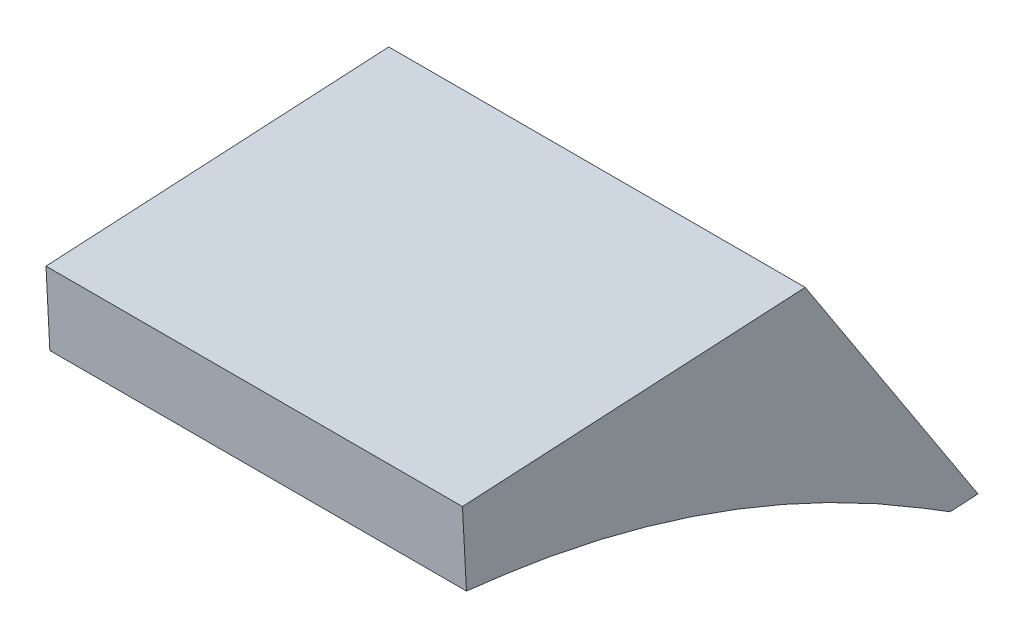
ISO-10303-21;
HEADER;
FILE_DESCRIPTION(('STEP AP214'),'2;1');
FILE_NAME('part.step','',(''),(''),'','','');
FILE_SCHEMA(('AUTOMOTIVE_DESIGN { 1 0 10303 214 1 1 1 1 }'));
ENDSEC;
DATA;
#1=APPLICATION_CONTEXT('core data for automotive mechanical design processes');
#2=APPLICATION_PROTOCOL_DEFINITION('international standard','automotive_design',2000,#1);
#3=PRODUCT_CONTEXT('',#1,'mechanical');
#4=PRODUCT('Part','Part','',(#3));
#5=PRODUCT_RELATED_PRODUCT_CATEGORY('part','',(#4));
#6=PRODUCT_DEFINITION_FORMATION('','',#4);
#7=PRODUCT_DEFINITION_CONTEXT('part definition',#1,'design');
#8=PRODUCT_DEFINITION('design','',#6,#7);
#9=PRODUCT_DEFINITION_SHAPE('','',#8);
#10=(LENGTH_UNIT() NAMED_UNIT(*) SI_UNIT(.MILLI.,.METRE.));
#11=(NAMED_UNIT(*) PLANE_ANGLE_UNIT() SI_UNIT($,.RADIAN.));
#12=(NAMED_UNIT(*) SI_UNIT($,.STERADIAN.) SOLID_ANGLE_UNIT());
#13=UNCERTAINTY_MEASURE_WITH_UNIT(LENGTH_MEASURE(1.E-05),#10,'distance_accuracy_value','');
#14=(GEOMETRIC_REPRESENTATION_CONTEXT(3) GLOBAL_UNCERTAINTY_ASSIGNED_CONTEXT((#13)) GLOBAL_UNIT_ASSIGNED_CONTEXT((#10,
#11,#12)) REPRESENTATION_CONTEXT('',''));
#15=CARTESIAN_POINT('',(0.,0.,0.));
#16=DIRECTION('',(0.,0.,1.));
#17=DIRECTION('',(1.,0.,0.));
#18=AXIS2_PLACEMENT_3D('',#15,#16,#17);
#19=CARTESIAN_POINT('',(-177.805940246243,-33.0381702413849,-314.355519034823));
#20=DIRECTION('',(-2.29475219526301E-07,0.0534934907984705,-0.998568198192863));
#21=DIRECTION('',(0.,0.99856819819289,0.053493490798472));
#22=AXIS2_PLACEMENT_3D('',#19,#20,#21);
#23=PLANE('',#22);
#24=CARTESIAN_POINT('',(-177.8,85.110750331542,-308.026258594133));
#25=CARTESIAN_POINT('',(-204.737394348035,85.1107449085178,-308.026252694317));
#26=CARTESIAN_POINT('',(-231.674788696068,85.1107454911889,-308.026246472776));
#27=CARTESIAN_POINT('',(-285.549577392135,85.1107586679218,-308.02623338624));
#28=CARTESIAN_POINT('',(-312.486971740168,85.1107712619836,-308.026226521246));
#29=CARTESIAN_POINT('',(-339.4243660882,85.1107898617407,-308.026219334526));
#30=B_SPLINE_CURVE_WITH_KNOTS('',3,(#24,#25,#26,#27,#28,#29),.UNSPECIFIED.,.F.,.F.,(4,2,4),(0.,
80.8121830441022,161.624366088213),.UNSPECIFIED.);
#31=CARTESIAN_POINT('',(-177.8,85.110750331542,-308.026258594133));
#32=VERTEX_POINT('',#31);
#33=CARTESIAN_POINT('',(-338.178220714968,85.1107887697366,-308.026219679411));
#34=VERTEX_POINT('',#33);
#35=EDGE_CURVE('E120',#32,#34,#30,.T.);
#36=ORIENTED_EDGE('',*,*,#35,.T.);
#37=DIRECTION('',(0.0023746530409731,0.998565382766486,0.0534933394298316));
#38=VECTOR('',#37,1.);
#39=CARTESIAN_POINT('',(-338.458280662959,-32.6572237938514,-314.335074741631));
#40=LINE('',#39,#38);
#41=CARTESIAN_POINT('',(-338.247088528495,56.1511835604797,-309.577591295045));
#42=VERTEX_POINT('',#41);
#43=EDGE_CURVE('E11',#42,#34,#40,.T.);
#44=ORIENTED_EDGE('',*,*,#43,.F.);
#45=CARTESIAN_POINT('',(-339.4243660882,56.15118359318,-309.577591022767));
#46=CARTESIAN_POINT('',(-285.549577392133,56.1511820966472,-309.577603483592));
#47=CARTESIAN_POINT('',(-231.674788696067,56.1511806001143,-309.577615944417));
#48=CARTESIAN_POINT('',(-177.8,56.1511791035814,-309.577628405242));
#49=B_SPLINE_CURVE_WITH_KNOTS('',3,(#45,#46,#47,#48),.UNSPECIFIED.,.F.,.F.,(4,4),(0.,
161.624366088204),.UNSPECIFIED.);
#50=CARTESIAN_POINT('',(-177.8,56.1511791040107,-309.577628401668));
#51=VERTEX_POINT('',#50);
#52=EDGE_CURVE('E49',#42,#51,#49,.T.);
#53=ORIENTED_EDGE('',*,*,#52,.T.);
#54=DIRECTION('',(0.,-0.99856819819289,-0.053493490798472));
#55=VECTOR('',#54,1.);
#56=CARTESIAN_POINT('',(-177.8,16.697356429359,-311.691177288541));
#57=LINE('',#56,#55);
#58=EDGE_CURVE('E107',#32,#51,#57,.T.);
#59=ORIENTED_EDGE('',*,*,#58,.F.);
#60=EDGE_LOOP('',(#36,#44,#53,#59));
#61=FACE_BOUND('',#60,.T.);
#62=ADVANCED_FACE('F42',(#61),#23,.F.);
#63=CARTESIAN_POINT('',(-338.458326349272,-22.0071834208376,-513.140414741347));
#64=DIRECTION('',(-0.999997180507466,0.00237124073306189,0.000127257626607574));
#65=DIRECTION('',(-0.00237124075226242,-0.999997188604695,0.));
#66=AXIS2_PLACEMENT_3D('',#63,#64,#65);
#67=PLANE('',#66);
#68=CARTESIAN_POINT('',(-338.178189933752,92.2083906021576,-440.036670150946));
#69=CARTESIAN_POINT('',(-338.178200434004,89.7872295623033,-395.004761254948));
#70=CARTESIAN_POINT('',(-338.178210934255,87.366068522449,-349.97285235895));
#71=CARTESIAN_POINT('',(-338.178221434506,84.9449074825947,-304.940943462951));
#72=B_SPLINE_CURVE_WITH_KNOTS('',3,(#68,#69,#70,#71),.UNSPECIFIED.,.F.,.F.,(4,4),(0.,
135.290848014145),.UNSPECIFIED.);
#73=CARTESIAN_POINT('',(-338.178189938581,92.208390602169,-440.036670150946));
#74=VERTEX_POINT('',#73);
#75=EDGE_CURVE('E113',#74,#34,#72,.T.);
#76=ORIENTED_EDGE('',*,*,#75,.F.);
#77=CARTESIAN_POINT('',(-338.431837937609,-11.1469924786984,-507.355257430313));
#78=CARTESIAN_POINT('',(-338.408916938738,-1.80724301481813,-501.271987354038));
#79=CARTESIAN_POINT('',(-338.385995938601,7.53250641209537,-495.188717221013));
#80=CARTESIAN_POINT('',(-338.340153936999,26.2120051929313,-483.022176842902));
#81=CARTESIAN_POINT('',(-338.317232935534,35.5517545468537,-476.938906597818));
#82=CARTESIAN_POINT('',(-338.255604598183,60.6637995458687,-460.582647738503));
#83=CARTESIAN_POINT('',(-338.216897262187,76.4360951242514,-450.309659021852));
#84=CARTESIAN_POINT('',(-338.178189928924,92.208390602169,-440.036670150946));
#85=B_SPLINE_CURVE_WITH_KNOTS('',3,(#77,#78,#79,#80,#81,#82,#83,#84),.UNSPECIFIED.,.F.,.F.,(4,2,
2,4),(0.,33.4385792486797,66.8771584973593,123.345821746806),.UNSPECIFIED.);
#86=CARTESIAN_POINT('',(-338.428909815339,-9.95401298745452,-506.577900493896));
#87=VERTEX_POINT('',#86);
#88=EDGE_CURVE('E162',#87,#74,#85,.T.);
#89=ORIENTED_EDGE('',*,*,#88,.F.);
#90=CARTESIAN_POINT('',(-338.428910514005,-9.95417148300831,-506.57767153548));
#91=CARTESIAN_POINT('',(-338.428910539208,-10.0069259570138,-505.594873412896));
#92=CARTESIAN_POINT('',(-338.428910564299,-10.0596804275362,-504.612075290126));
#93=CARTESIAN_POINT('',(-338.428910614351,-10.1651893616146,-502.64647904421));
#94=CARTESIAN_POINT('',(-338.428910639312,-10.2179438251707,-501.663680921065));
#95=CARTESIAN_POINT('',(-338.428910706009,-10.3590122650935,-499.035622595269));
#96=CARTESIAN_POINT('',(-338.428910747711,-10.4473262351817,-497.390362392281));
#97=CARTESIAN_POINT('',(-338.428910789578,-10.535640195508,-495.745102188769));
#98=B_SPLINE_CURVE_WITH_KNOTS('',3,(#90,#91,#92,#93,#94,#95,#96,#97),.UNSPECIFIED.,.F.,.F.,(4,2,
2,4),(0.,2.95263893128455,5.90527786256939,10.8481641080384),.UNSPECIFIED.);
#99=CARTESIAN_POINT('',(-338.428910053783,-10.5318760424426,-495.810901745932));
#100=VERTEX_POINT('',#99);
#101=EDGE_CURVE('E114',#87,#100,#98,.T.);
#102=ORIENTED_EDGE('',*,*,#101,.T.);
#103=DIRECTION('',(-0.00135449772366032,-0.525559783831621,-0.850755592961208));
#104=VECTOR('',#103,1.);
#105=CARTESIAN_POINT('',(-338.413417955101,-4.52070771895822,-486.080157673915));
#106=LINE('',#105,#104);
#107=CARTESIAN_POINT('',(-338.413712627311,-4.63504372721386,-486.265240325771));
#108=VERTEX_POINT('',#107);
#109=EDGE_CURVE('E161',#108,#100,#106,.T.);
#110=ORIENTED_EDGE('',*,*,#109,.F.);
#111=CARTESIAN_POINT('',(-338.245193516812,56.701510452045,-304.940943462951));
#112=CARTESIAN_POINT('',(-338.245473966705,56.6203852093187,-305.633095470086));
#113=CARTESIAN_POINT('',(-338.245755539894,56.5387832470412,-306.325191506279));
#114=CARTESIAN_POINT('',(-338.246320785259,56.3746885328478,-307.709279089255));
#115=CARTESIAN_POINT('',(-338.246604457438,56.2921957795255,-308.401270635871));
#116=CARTESIAN_POINT('',(-338.247173752533,56.1263823171187,-309.785155108789));
#117=CARTESIAN_POINT('',(-338.247459375451,56.0430616073133,-310.477048035004));
#118=CARTESIAN_POINT('',(-338.248032471305,55.875639293863,-311.860820732886));
#119=CARTESIAN_POINT('',(-338.248319944452,55.7915376008118,-312.552700493729));
#120=CARTESIAN_POINT('',(-338.248896516908,55.6226439118887,-313.936375804408));
#121=CARTESIAN_POINT('',(-338.249185616218,55.5378519160434,-314.628171354247));
#122=CARTESIAN_POINT('',(-338.249766279509,55.3672216145698,-316.011633683542));
#123=CARTESIAN_POINT('',(-338.250057843491,55.2813833086739,-316.703300462965));
#124=CARTESIAN_POINT('',(-338.250791455421,55.0648536632202,-318.433381027977));
#125=CARTESIAN_POINT('',(-338.251235621626,54.9332629970909,-319.471682687473));
#126=CARTESIAN_POINT('',(-338.252134588076,54.6655659526797,-321.547705847517));
#127=CARTESIAN_POINT('',(-338.252589388324,54.5294595735725,-322.58542734796));
#128=CARTESIAN_POINT('',(-338.253512620617,54.2514538661401,-324.660047463545));
#129=CARTESIAN_POINT('',(-338.253981052032,54.1095548051371,-325.696946114414));
#130=CARTESIAN_POINT('',(-338.254934579946,53.81867549613,-327.769752017501));
#131=CARTESIAN_POINT('',(-338.255419676411,53.6696952622995,-328.805659271699));
#132=CARTESIAN_POINT('',(-338.256162025501,53.4399724226615,-330.3585629953));
#133=CARTESIAN_POINT('',(-338.256411918463,53.3623584048005,-330.876023038004));
#134=CARTESIAN_POINT('',(-338.256917016466,53.2048717092642,-331.910599230866));
#135=CARTESIAN_POINT('',(-338.257172221505,53.1249990318647,-332.427715381067));
#136=CARTESIAN_POINT('',(-338.2579458082,52.8819907618856,-333.9785332789));
#137=CARTESIAN_POINT('',(-338.25847216201,52.7154647519583,-335.011705689106));
#138=CARTESIAN_POINT('',(-338.259545604024,52.3735913574122,-337.076610365416));
#139=CARTESIAN_POINT('',(-338.260092692666,52.1982437858711,-338.108342600528));
#140=CARTESIAN_POINT('',(-338.261207130495,51.838923751396,-340.170304556825));
#141=CARTESIAN_POINT('',(-338.261774479693,51.6549512835574,-341.200534277156));
#142=CARTESIAN_POINT('',(-338.262928886155,51.2786053575684,-343.259321829091));
#143=CARTESIAN_POINT('',(-338.263515940897,51.0862329733405,-344.287879857081));
#144=CARTESIAN_POINT('',(-338.26470937735,50.6932531205697,-346.34342073736));
#145=CARTESIAN_POINT('',(-338.265315759059,50.4926456525683,-347.370403589754));
#146=CARTESIAN_POINT('',(-338.266547341045,50.0834086741622,-349.422768760564));
#147=CARTESIAN_POINT('',(-338.2671725413,49.8747791728674,-350.448151080797));
#148=CARTESIAN_POINT('',(-338.268441570017,49.4495756895697,-352.497264576558));
#149=CARTESIAN_POINT('',(-338.269085398479,49.2330017081198,-353.520995752201));
#150=CARTESIAN_POINT('',(-338.271044917088,48.5713148287447,-356.589528571199));
#151=CARTESIAN_POINT('',(-338.272388695292,48.1142187774382,-358.631760896885));
#152=CARTESIAN_POINT('',(-338.275151397732,47.1679354784338,-362.708759358508));
#153=CARTESIAN_POINT('',(-338.276570321685,46.6787483524871,-364.743525522739));
#154=CARTESIAN_POINT('',(-338.279483790334,45.6680554201229,-368.805083156432));
#155=CARTESIAN_POINT('',(-338.280978337101,45.1465487290261,-370.831874405981));
#156=CARTESIAN_POINT('',(-338.28404225878,44.0715213319483,-374.876930893484));
#157=CARTESIAN_POINT('',(-338.285611633839,43.5180005639597,-376.895196114917));
#158=CARTESIAN_POINT('',(-338.290367792826,41.8322356402949,-382.857833830222));
#159=CARTESIAN_POINT('',(-338.293659764951,40.6549538490373,-386.789577011825));
#160=CARTESIAN_POINT('',(-338.300520997692,38.1814074086131,-394.614957282709));
#161=CARTESIAN_POINT('',(-338.304090233577,36.8851533688928,-398.508597735631));
#162=CARTESIAN_POINT('',(-338.311499873468,34.1760789510816,-406.254706291461));
#163=CARTESIAN_POINT('',(-338.315340247209,32.7632715789966,-410.107178934177));
#164=CARTESIAN_POINT('',(-338.321299384641,30.5585280540555,-415.852555434517));
#165=CARTESIAN_POINT('',(-338.323318717848,29.8094112376908,-417.761998593666));
#166=CARTESIAN_POINT('',(-338.327422996422,28.2828993273127,-421.569548631777));
#167=CARTESIAN_POINT('',(-338.329507941747,27.5055042515337,-423.467655518049));
#168=CARTESIAN_POINT('',(-338.335858462413,25.1319785510044,-429.143558471762));
#169=CARTESIAN_POINT('',(-338.340220807824,23.4941058489482,-432.903982560616));
#170=CARTESIAN_POINT('',(-338.349192499034,20.1115040777148,-440.374676744563));
#171=CARTESIAN_POINT('',(-338.353801749513,18.3668162091669,-444.084965512056));
#172=CARTESIAN_POINT('',(-338.361340442936,15.5028631334038,-449.959269446135));
#173=CARTESIAN_POINT('',(-338.364192432218,14.4171429126823,-452.139706375322));
#174=CARTESIAN_POINT('',(-338.369978657166,12.210016581656,-456.481927660163));
#175=CARTESIAN_POINT('',(-338.372912876742,11.0886174469528,-458.643715558112));
#176=CARTESIAN_POINT('',(-338.378863021013,8.81034014818142,-462.948239985106));
#177=CARTESIAN_POINT('',(-338.381878937721,7.65346545073977,-465.090978349417));
#178=CARTESIAN_POINT('',(-338.38801039612,5.29734914193207,-469.369874341495));
#179=CARTESIAN_POINT('',(-338.391126428528,4.09789428521723,-471.505914560415));
#180=CARTESIAN_POINT('',(-338.397440191624,1.66345241784423,-475.757900007412));
#181=CARTESIAN_POINT('',(-338.400637929487,0.428462285647057,-477.873843448271));
#182=CARTESIAN_POINT('',(-338.40711465415,-2.07688417952388,-482.085196654552));
#183=CARTESIAN_POINT('',(-338.410393655276,-3.34724675273909,-484.180602707574));
#184=CARTESIAN_POINT('',(-338.413712627311,-4.63504372721387,-486.265240325771));
#185=B_SPLINE_CURVE_WITH_KNOTS('',3,(#111,#112,#113,#114,#115,#116,#117,#118,#119,#120,#121,
#122,#123,#124,#125,#126,#127,#128,#129,#130,#131,#132,#133,#134,#135,#136,#137,#138,#139,#140,
#141,#142,#143,#144,#145,#146,#147,#148,#149,#150,#151,#152,#153,#154,#155,#156,#157,#158,#159,
#160,#161,#162,#163,#164,#165,#166,#167,#168,#169,#170,#171,#172,#173,#174,#175,#176,#177,#178,
#179,#180,#181,#182,#183,#184),.UNSPECIFIED.,.F.,.F.,(4,2,2,2,2,2,2,2,2,2,2,2,2,2,2,2,2,2,2,2,2,
2,2,2,2,2,2,2,2,2,2,2,2,2,2,2,4),(0.,2.09066993627693,4.181343173718,6.27201823126996,
8.36293565233996,10.4538529930911,12.5447708690147,15.6845852531985,18.8244002111494,
21.9640704355601,25.103734375937,26.6734752243518,28.2432158811304,31.3826935092077,
34.5222376884896,37.6617836530655,40.8009293978036,43.9400749361641,47.0792169097819,
50.2183586649396,56.4963626402372,62.7743427986535,69.0524948793963,75.330659120593,
87.6412006560301,99.9506454536364,112.258718512511,118.411929825833,124.565137171538,
136.868192629749,149.166532104962,156.473623665983,163.779295288176,171.084255270299,
178.433222488442,185.782837247546,193.133756910619),.UNSPECIFIED.);
#186=EDGE_CURVE('E154',#42,#108,#185,.T.);
#187=ORIENTED_EDGE('',*,*,#186,.F.);
#188=ORIENTED_EDGE('',*,*,#43,.T.);
#189=EDGE_LOOP('',(#76,#89,#102,#110,#187,#188));
#190=FACE_BOUND('',#189,.T.);
#191=ADVANCED_FACE('F170',(#190),#67,.T.);
#192=CARTESIAN_POINT('',(-177.8,65.8781508423885,49.6962411892493));
#193=CARTESIAN_POINT('',(-231.516137288527,65.8787970451198,49.684221947819));
#194=CARTESIAN_POINT('',(-328.898817793057,65.8799587745919,49.6624290270975));
#195=CARTESIAN_POINT('',(-430.301749554133,65.8795676334247,49.6392318840312));
#196=CARTESIAN_POINT('',(-478.536378495178,65.8944796643632,49.6329561991434));
#197=CARTESIAN_POINT('',(-484.553750526313,65.8801569539115,49.62707278082));
#198=CARTESIAN_POINT('',(-485.331531687459,65.8700020364117,49.6236952041893));
#199=CARTESIAN_POINT('',(-485.744527490584,65.8838878926665,49.627977729598));
#200=CARTESIAN_POINT('',(-486.040270716771,65.8993784286855,49.6327926933882));
#201=CARTESIAN_POINT('',(-486.556396633948,65.9602372100236,49.651856532687));
#202=CARTESIAN_POINT('',(-487.317873690559,66.0137555468449,49.6685510047104));
#203=CARTESIAN_POINT('',(-488.239730119881,66.0950282411789,49.6939565152748));
#204=CARTESIAN_POINT('',(-489.559339697561,66.2103395815435,49.7299997134027));
#205=CARTESIAN_POINT('',(-490.486101932218,66.2905952519518,49.7550835652258));
#206=CARTESIAN_POINT('',(-491.107536578648,66.3445114865218,49.7719353115469));
#207=CARTESIAN_POINT('',(-177.8,74.6548216331163,-113.548078269781));
#208=CARTESIAN_POINT('',(-231.579974335744,74.655252434937,-113.556091097401));
#209=CARTESIAN_POINT('',(-329.085323869404,74.6560228824289,-113.570620546676));
#210=CARTESIAN_POINT('',(-430.425747152048,74.6560404333492,-113.586027737782));
#211=CARTESIAN_POINT('',(-478.552015447206,74.6690366969826,-113.589579595877));
#212=CARTESIAN_POINT('',(-484.557146346177,74.6551946697141,-113.594390029726));
#213=CARTESIAN_POINT('',(-485.334083909181,74.6445154674445,-113.597450407754));
#214=CARTESIAN_POINT('',(-485.744700304045,74.6598119040633,-113.593346135502));
#215=CARTESIAN_POINT('',(-486.032139732393,74.6761191709517,-113.588899099885));
#216=CARTESIAN_POINT('',(-486.482546738094,74.7359898087317,-113.572197908095));
#217=CARTESIAN_POINT('',(-487.138956506633,74.7871913881035,-113.55785727129));
#218=CARTESIAN_POINT('',(-487.922810441756,74.8606870318585,-113.536925044651));
#219=CARTESIAN_POINT('',(-489.038035338706,74.9653658189383,-113.507144656348));
#220=CARTESIAN_POINT('',(-489.817904728499,75.0386262870922,-113.486335263897));
#221=CARTESIAN_POINT('',(-490.341175821834,75.0877184236467,-113.472381004376));
#222=CARTESIAN_POINT('',(-177.8,83.4314924238441,-276.792397728811));
#223=CARTESIAN_POINT('',(-231.64381138296,83.4317078247542,-276.79640414262));
#224=CARTESIAN_POINT('',(-329.271829945751,83.4320869902656,-276.80367012045));
#225=CARTESIAN_POINT('',(-430.549744749963,83.4325132332734,-276.811287359595));
#226=CARTESIAN_POINT('',(-478.567652399233,83.4435937296021,-276.812115390897));
#227=CARTESIAN_POINT('',(-484.560542166041,83.4302323855168,-276.815852840272));
#228=CARTESIAN_POINT('',(-485.336636130903,83.4190288984773,-276.818596019698));
#229=CARTESIAN_POINT('',(-485.744873117508,83.4357359154601,-276.814670000602));
#230=CARTESIAN_POINT('',(-486.024008748016,83.452859913218,-276.810590893159));
#231=CARTESIAN_POINT('',(-486.408696842241,83.5117424074398,-276.796252348878));
#232=CARTESIAN_POINT('',(-486.960039322706,83.5606272293622,-276.784265547289));
#233=CARTESIAN_POINT('',(-487.605890763631,83.6263458225381,-276.767806604576));
#234=CARTESIAN_POINT('',(-488.51673097985,83.7203920563331,-276.744289026098));
#235=CARTESIAN_POINT('',(-489.14970752478,83.7866573222327,-276.72775409302));
#236=CARTESIAN_POINT('',(-489.57481506502,83.8309253607717,-276.716697320298));
#237=CARTESIAN_POINT('',(-177.8,92.2081632145719,-440.036717187841));
#238=CARTESIAN_POINT('',(-231.707648430177,92.2081632145713,-440.03671718784));
#239=CARTESIAN_POINT('',(-329.458336022097,92.2081510981023,-440.036719694223));
#240=CARTESIAN_POINT('',(-430.673742347878,92.2089860331975,-440.036546981408));
#241=CARTESIAN_POINT('',(-478.58328935126,92.2181507622215,-440.034651185918));
#242=CARTESIAN_POINT('',(-484.563937985906,92.2052701013194,-440.037315650818));
#243=CARTESIAN_POINT('',(-485.339188352625,92.1935423295101,-440.039741631642));
#244=CARTESIAN_POINT('',(-485.74504593097,92.211659926857,-440.035993865702));
#245=CARTESIAN_POINT('',(-486.015877763639,92.2296006554842,-440.032282686432));
#246=CARTESIAN_POINT('',(-486.334846946387,92.2874950061478,-440.02030678966));
#247=CARTESIAN_POINT('',(-486.781122138779,92.3340630706208,-440.010673823289));
#248=CARTESIAN_POINT('',(-487.288971085506,92.3920046132177,-439.998688164502));
#249=CARTESIAN_POINT('',(-487.995426620994,92.4754182937279,-439.981433395848));
#250=CARTESIAN_POINT('',(-488.481510321061,92.5346883573731,-439.969172922142));
#251=CARTESIAN_POINT('',(-488.808454308207,92.5741322978967,-439.961013636221));
#252=B_SPLINE_SURFACE_WITH_KNOTS('',3,3,((#192,#193,#194,#195,#196,#197,#198,#199,#200,#201,
#202,#203,#204,#205,#206),(#207,#208,#209,#210,#211,#212,#213,#214,#215,#216,#217,#218,#219,
#220,#221),(#222,#223,#224,#225,#226,#227,#228,#229,#230,#231,#232,#233,#234,#235,#236),(#237,
#238,#239,#240,#241,#242,#243,#244,#245,#246,#247,#248,#249,#250,#251)),.UNSPECIFIED.,.F.,.F.,
.F.,(4,4),(4,1,1,1,1,1,1,1,1,1,1,1,4),(0.,1.),(0.,0.5,0.90625,0.95703125,0.9609375,0.9638671875,
0.96450845898134,0.96484375,0.966796875,0.970703125,0.9765625,0.984375,1.),.UNSPECIFIED.);
#253=DIRECTION('',(0.,0.0536864833252265,-0.998557840842567));
#254=VECTOR('',#253,1.);
#255=CARTESIAN_POINT('',(-177.8,65.8781508423885,49.6962411892494));
#256=LINE('',#255,#254);
#257=CARTESIAN_POINT('',(-177.8,92.2081632145719,-440.03671718784));
#258=VERTEX_POINT('',#257);
#259=EDGE_CURVE('E77',#32,#258,#256,.T.);
#260=CARTESIAN_POINT('',(-177.8,92.2081632145719,-440.036717187841));
#261=CARTESIAN_POINT('',(-231.707648430177,92.2081632145713,-440.03671718784));
#262=CARTESIAN_POINT('',(-329.458336022097,92.2081510981023,-440.036719694223));
#263=CARTESIAN_POINT('',(-430.673742347878,92.2089860331975,-440.036546981408));
#264=CARTESIAN_POINT('',(-478.58328935126,92.2181507622215,-440.034651185918));
#265=CARTESIAN_POINT('',(-484.563937985906,92.2052701013194,-440.037315650818));
#266=CARTESIAN_POINT('',(-485.339188352625,92.1935423295101,-440.039741631642));
#267=CARTESIAN_POINT('',(-485.74504593097,92.211659926857,-440.035993865702));
#268=CARTESIAN_POINT('',(-486.015877763639,92.2296006554842,-440.032282686432));
#269=CARTESIAN_POINT('',(-486.334846946387,92.2874950061478,-440.02030678966));
#270=CARTESIAN_POINT('',(-486.781122138779,92.3340630706208,-440.010673823289));
#271=CARTESIAN_POINT('',(-487.288971085506,92.3920046132177,-439.998688164502));
#272=CARTESIAN_POINT('',(-487.995426620994,92.4754182937279,-439.981433395848));
#273=CARTESIAN_POINT('',(-488.481510321061,92.5346883573731,-439.969172922142));
#274=CARTESIAN_POINT('',(-488.808454308207,92.5741322978967,-439.961013636221));
#275=B_SPLINE_CURVE_WITH_KNOTS('',3,(#260,#261,#262,#263,#264,#265,#266,#267,#268,#269,#270,
#271,#272,#273,#274),.UNSPECIFIED.,.F.,.F.,(4,1,1,1,1,1,1,1,1,1,1,1,4),(0.,0.5,0.90625,
0.95703125,0.9609375,0.9638671875,0.96450845898134,0.96484375,0.966796875,0.970703125,0.9765625,
0.984375,1.),.UNSPECIFIED.);
#276=EDGE_CURVE('E219',#258,#74,#275,.T.);
#277=ORIENTED_EDGE('',*,*,#35,.F.);
#278=ORIENTED_EDGE('',*,*,#259,.T.);
#279=ORIENTED_EDGE('',*,*,#276,.T.);
#280=ORIENTED_EDGE('',*,*,#75,.T.);
#281=EDGE_LOOP('',(#277,#278,#279,#280));
#282=FACE_BOUND('',#281,.T.);
#283=ADVANCED_FACE('F174',(#282),#252,.T.);
#284=CARTESIAN_POINT('',(-177.8,0.,0.));
#285=DIRECTION('',(-1.,0.,0.));
#286=DIRECTION('',(0.,0.,1.));
#287=AXIS2_PLACEMENT_3D('',#284,#285,#286);
#288=PLANE('',#287);
#289=ORIENTED_EDGE('',*,*,#259,.F.);
#290=ORIENTED_EDGE('',*,*,#58,.T.);
#291=CARTESIAN_POINT('',(-177.8,-4.63504372721387,-486.265240325771));
#292=CARTESIAN_POINT('',(-177.8,1.83078834545628,-475.798604619994));
#293=CARTESIAN_POINT('',(-177.8,13.88926974822,-454.312764268715));
#294=CARTESIAN_POINT('',(-177.8,29.2245092391949,-420.690900195696));
#295=CARTESIAN_POINT('',(-177.8,39.4662975955996,-391.639559871781));
#296=CARTESIAN_POINT('',(-177.8,46.0383471864307,-367.906811920152));
#297=CARTESIAN_POINT('',(-177.8,50.1289716166113,-349.897665028212));
#298=CARTESIAN_POINT('',(-177.8,53.3958988659329,-331.712828111795));
#299=CARTESIAN_POINT('',(-177.8,55.714700607055,-313.408651411274));
#300=CARTESIAN_POINT('',(-177.8,57.8672725021249,-295.107197371007));
#301=CARTESIAN_POINT('',(-177.8,60.3514671040502,-270.6545199273));
#302=CARTESIAN_POINT('',(-177.8,62.7920862835124,-240.027554240449));
#303=CARTESIAN_POINT('',(-177.8,64.5518412881872,-203.195919164225));
#304=CARTESIAN_POINT('',(-177.8,65.0284962278422,-166.320848877817));
#305=CARTESIAN_POINT('',(-177.8,64.0618587849313,-129.448182963541));
#306=CARTESIAN_POINT('',(-177.8,61.4272131768156,-92.6473789600514));
#307=CARTESIAN_POINT('',(-177.8,57.5903132654066,-62.1278910615713));
#308=CARTESIAN_POINT('',(-177.8,53.2997551007173,-37.896239171482));
#309=CARTESIAN_POINT('',(-177.8,49.3855068860328,-19.8527900849958));
#310=CARTESIAN_POINT('',(-177.8,44.6602421800703,-1.99498265798601));
#311=CARTESIAN_POINT('',(-177.8,39.9109380351398,12.6617143775167));
#312=CARTESIAN_POINT('',(-177.8,35.489238489374,24.1743679264121));
#313=CARTESIAN_POINT('',(-177.8,31.8084283862062,32.6687242753332));
#314=CARTESIAN_POINT('',(-177.8,27.6918547943622,40.974488962412));
#315=CARTESIAN_POINT('',(-177.8,23.0319323917029,49.0126857131575));
#316=CARTESIAN_POINT('',(-177.8,17.6580792712106,56.6339395967455));
#317=CARTESIAN_POINT('',(-177.8,12.3453248319818,62.404116232879));
#318=CARTESIAN_POINT('',(-177.8,7.32735483393856,66.2701140204816));
#319=CARTESIAN_POINT('',(-177.8,3.09941750836411,68.5714980011858));
#320=CARTESIAN_POINT('',(-177.8,-0.452354776864283,69.5610109929074));
#321=CARTESIAN_POINT('',(-177.8,-2.88445310451718,69.7917971271235));
#322=CARTESIAN_POINT('',(-177.8,-4.12527062577326,69.8176285587099));
#323=CARTESIAN_POINT('',(-177.8,-5.36659154709746,69.7196954311463));
#324=CARTESIAN_POINT('',(-177.8,-6.13001958673486,69.6175918349424));
#325=CARTESIAN_POINT('',(-177.8,-6.51913907058263,69.5663617744474));
#326=B_SPLINE_CURVE_WITH_KNOTS('',3,(#291,#292,#293,#294,#295,#296,#297,#298,#299,#300,#301,
#302,#303,#304,#305,#306,#307,#308,#309,#310,#311,#312,#313,#314,#315,#316,#317,#318,#319,#320,
#321,#322,#323,#324,#325),.UNSPECIFIED.,.F.,.F.,(4,1,1,1,1,1,1,1,1,1,1,1,1,1,1,1,1,1,1,1,1,1,1,
1,1,1,1,1,1,1,1,1,4),(0.,0.0625041235375069,0.125008247075014,0.187512370612521,
0.218764432381274,0.250016494150027,0.281268555918781,0.312520617687534,0.343772679456288,
0.375024741225041,0.437528864762549,0.500032988300055,0.562537111837562,0.625041235375069,
0.687545358912576,0.750049482450083,0.781301544218836,0.81255360598759,0.843805667756343,
0.875057729525097,0.890683760409473,0.90630979129385,0.921935822178227,0.937561853062603,
0.95318788394698,0.968813914831357,0.976626930273545,0.984439945715734,0.992252961157922,
0.994206215018469,0.996159468879016,0.998112722739563,1.00006597660011),.UNSPECIFIED.);
#327=CARTESIAN_POINT('',(-177.8,-4.63504372721387,-486.265240325771));
#328=VERTEX_POINT('',#327);
#329=EDGE_CURVE('E69',#328,#51,#326,.T.);
#330=ORIENTED_EDGE('',*,*,#329,.F.);
#331=DIRECTION('',(0.,0.525560265945114,0.850756373387647));
#332=VECTOR('',#331,1.);
#333=CARTESIAN_POINT('',(-177.8,-4.63504372721387,-486.265240325771));
#334=LINE('',#333,#332);
#335=CARTESIAN_POINT('',(-177.8,-10.5327484317238,-495.81221370036));
#336=VERTEX_POINT('',#335);
#337=EDGE_CURVE('E61',#336,#328,#334,.T.);
#338=ORIENTED_EDGE('',*,*,#337,.F.);
#339=DIRECTION('',(0.,0.0536864833252206,-0.998557840842568));
#340=VECTOR('',#339,1.);
#341=CARTESIAN_POINT('',(-177.8,-10.2433380586428,-501.195188694467));
#342=LINE('',#341,#340);
#343=CARTESIAN_POINT('',(-177.8,-9.95392768556176,-506.578163688574));
#344=VERTEX_POINT('',#343);
#345=EDGE_CURVE('E243',#336,#344,#342,.T.);
#346=ORIENTED_EDGE('',*,*,#345,.T.);
#347=DIRECTION('',(0.,-0.837933215655186,-0.545772778820783));
#348=VECTOR('',#347,1.);
#349=CARTESIAN_POINT('',(-177.8,92.2081632145719,-440.03671718784));
#350=LINE('',#349,#348);
#351=EDGE_CURVE('E132',#258,#344,#350,.T.);
#352=ORIENTED_EDGE('',*,*,#351,.F.);
#353=EDGE_LOOP('',(#289,#290,#330,#338,#346,#352));
#354=FACE_BOUND('',#353,.T.);
#355=ADVANCED_FACE('F109',(#354),#288,.F.);
#356=CARTESIAN_POINT('',(-177.8,-10.5327484317238,-495.81221370036));
#357=CARTESIAN_POINT('',(-274.207207620428,-10.532748431724,-495.81221370036));
#358=CARTESIAN_POINT('',(-376.016408166547,-10.532743263631,-495.812208410507));
#359=CARTESIAN_POINT('',(-478.598502144422,-10.52834825828,-495.807709851592));
#360=CARTESIAN_POINT('',(-484.78976742605,-10.5346710511193,-495.814181619831));
#361=CARTESIAN_POINT('',(-485.586919347094,-10.5438544894442,-495.823581435074));
#362=CARTESIAN_POINT('',(-485.898481465598,-10.5318587580024,-495.811303064461));
#363=CARTESIAN_POINT('',(-486.364982708455,-10.4951657543597,-495.773745513276));
#364=CARTESIAN_POINT('',(-490.154991884245,-10.2587392399741,-495.531748401184));
#365=CARTESIAN_POINT('',(-493.937468198988,-10.0216632597841,-495.289086520806));
#366=CARTESIAN_POINT('',(-497.394940800443,-9.80517690591262,-495.06749939222));
#367=CARTESIAN_POINT('',(-177.8,-10.3398081830031,-499.400863696431));
#368=CARTESIAN_POINT('',(-274.209418385163,-10.3398081830033,-499.400863696431));
#369=CARTESIAN_POINT('',(-376.020964999451,-10.3398096449536,-499.400850263422));
#370=CARTESIAN_POINT('',(-478.598950286788,-10.3373942044883,-499.396812477319));
#371=CARTESIAN_POINT('',(-484.789762654161,-10.3409407130188,-499.402476865087));
#372=CARTESIAN_POINT('',(-485.586696813438,-10.3474601962453,-499.407941600412));
#373=CARTESIAN_POINT('',(-485.898471801464,-10.3387856060166,-499.40112355767));
#374=CARTESIAN_POINT('',(-486.365645745773,-10.312296407861,-499.380177483482));
#375=CARTESIAN_POINT('',(-490.159006538096,-10.1388025714563,-499.250895227081));
#376=CARTESIAN_POINT('',(-493.938944912067,-9.96427417884317,-499.122384197364));
#377=CARTESIAN_POINT('',(-497.394170964434,-9.8052415520001,-499.0043512248));
#378=CARTESIAN_POINT('',(-177.8,-10.1468679342825,-502.989513692503));
#379=CARTESIAN_POINT('',(-274.211629149898,-10.1468679342826,-502.989513692501));
#380=CARTESIAN_POINT('',(-376.025521832354,-10.1468760262763,-502.989492116337));
#381=CARTESIAN_POINT('',(-478.599398429154,-10.1464401506966,-502.985915103046));
#382=CARTESIAN_POINT('',(-484.789757882272,-10.1472103749182,-502.990772110343));
#383=CARTESIAN_POINT('',(-485.586474279782,-10.1510659030465,-502.99230176575));
#384=CARTESIAN_POINT('',(-485.898462137329,-10.1457124540309,-502.990944050878));
#385=CARTESIAN_POINT('',(-486.366308783091,-10.1294270613623,-502.986609453688));
#386=CARTESIAN_POINT('',(-490.163021191948,-10.0188659029384,-502.970042052979));
#387=CARTESIAN_POINT('',(-493.940421625146,-9.9068850979022,-502.955681873922));
#388=CARTESIAN_POINT('',(-497.393401128424,-9.80530619808759,-502.94120305738));
#389=CARTESIAN_POINT('',(-177.8,-9.9539276855618,-506.578163688574));
#390=CARTESIAN_POINT('',(-274.213839914632,-9.95392768556193,-506.578163688573));
#391=CARTESIAN_POINT('',(-376.030078665256,-9.95394240759896,-506.578133969256));
#392=CARTESIAN_POINT('',(-478.59984657152,-9.95548609690482,-506.575017728773));
#393=CARTESIAN_POINT('',(-484.789753110383,-9.95348003681767,-506.579067355599));
#394=CARTESIAN_POINT('',(-485.586251746126,-9.95467160984757,-506.576661931089));
#395=CARTESIAN_POINT('',(-485.898452473195,-9.95263930204514,-506.580764544087));
#396=CARTESIAN_POINT('',(-486.366971820409,-9.94655771486366,-506.593041423894));
#397=CARTESIAN_POINT('',(-490.1670358458,-9.89892923442059,-506.689188878877));
#398=CARTESIAN_POINT('',(-493.941898338224,-9.84949601696124,-506.78897955048));
#399=CARTESIAN_POINT('',(-497.392631292415,-9.80537084417507,-506.878054889959));
#400=B_SPLINE_SURFACE_WITH_KNOTS('',3,3,((#356,#357,#358,#359,#360,#361,#362,#363,#364,#365,
#366),(#367,#368,#369,#370,#371,#372,#373,#374,#375,#376,#377),(#378,#379,#380,#381,#382,#383,
#384,#385,#386,#387,#388),(#389,#390,#391,#392,#393,#394,#395,#396,#397,#398,#399)),
.UNSPECIFIED.,.F.,.F.,.F.,(4,4),(4,1,1,1,1,1,1,1,4),(0.,1.),(0.,0.90625,0.95703125,0.962890625,
0.96435546875,0.96450845898134,0.9658203125,0.96875,1.),.UNSPECIFIED.);
#401=CARTESIAN_POINT('',(-177.8,-9.9539276855618,-506.578163688574));
#402=CARTESIAN_POINT('',(-184.492109557943,-9.95392581929922,-506.578162473016));
#403=CARTESIAN_POINT('',(-191.184219115886,-9.95392396179126,-506.578161259337));
#404=CARTESIAN_POINT('',(-204.568553401078,-9.9539201467609,-506.578158814543));
#405=CARTESIAN_POINT('',(-211.260778128328,-9.95391818923678,-506.578157583428));
#406=CARTESIAN_POINT('',(-224.645393980207,-9.9539140566552,-506.57815508258));
#407=CARTESIAN_POINT('',(-231.337785104836,-9.95391188159234,-506.578153812845));
#408=CARTESIAN_POINT('',(-244.722784979009,-9.9539071964226,-506.578151213577));
#409=CARTESIAN_POINT('',(-251.415393728552,-9.95390468630483,-506.57814988404));
#410=CARTESIAN_POINT('',(-264.800880079547,-9.95389921350466,-506.578147143985));
#411=CARTESIAN_POINT('',(-271.493757681,-9.95389625080408,-506.578145733463));
#412=CARTESIAN_POINT('',(-284.879832962272,-9.95388975535896,-506.578142810255));
#413=CARTESIAN_POINT('',(-291.573030642092,-9.95388622258717,-506.578141297566));
#414=CARTESIAN_POINT('',(-304.959797306017,-9.9538784693745,-506.578138148835));
#415=CARTESIAN_POINT('',(-311.653366290123,-9.95387424889549,-506.578136512787));
#416=CARTESIAN_POINT('',(-325.040926788858,-9.95386500319498,-506.578133096189));
#417=CARTESIAN_POINT('',(-331.734918303486,-9.9538599779227,-506.57813131563));
#418=CARTESIAN_POINT('',(-338.428909818114,-9.95385449190305,-506.578129452306));
#419=B_SPLINE_CURVE_WITH_KNOTS('',3,(#401,#402,#403,#404,#405,#406,#407,#408,#409,#410,#411,
#412,#413,#414,#415,#416,#417,#418),.UNSPECIFIED.,.F.,.F.,(4,2,2,2,2,2,2,2,4),(0.,
20.0763286738296,40.15300285558,60.2301762294693,80.3080024781,100.38663528246,120.466228321922,
140.546935274245,160.628909818137),.UNSPECIFIED.);
#420=EDGE_CURVE('E245',#344,#87,#419,.T.);
#421=CARTESIAN_POINT('',(-177.8,-10.5327484317238,-495.81221370036));
#422=CARTESIAN_POINT('',(-274.207207620428,-10.532748431724,-495.81221370036));
#423=CARTESIAN_POINT('',(-376.016408166547,-10.532743263631,-495.812208410507));
#424=CARTESIAN_POINT('',(-478.598502144422,-10.52834825828,-495.807709851592));
#425=CARTESIAN_POINT('',(-484.78976742605,-10.5346710511193,-495.814181619831));
#426=CARTESIAN_POINT('',(-485.586919347094,-10.5438544894442,-495.823581435074));
#427=CARTESIAN_POINT('',(-485.898481465598,-10.5318587580024,-495.811303064461));
#428=CARTESIAN_POINT('',(-486.364982708455,-10.4951657543597,-495.773745513276));
#429=CARTESIAN_POINT('',(-490.154991884245,-10.2587392399741,-495.531748401184));
#430=CARTESIAN_POINT('',(-493.937468198988,-10.0216632597841,-495.289086520806));
#431=CARTESIAN_POINT('',(-497.394940800443,-9.80517690591262,-495.06749939222));
#432=B_SPLINE_CURVE_WITH_KNOTS('',3,(#421,#422,#423,#424,#425,#426,#427,#428,#429,#430,#431),
.UNSPECIFIED.,.F.,.F.,(4,1,1,1,1,1,1,1,4),(0.,0.90625,0.95703125,0.962890625,0.96435546875,
0.96450845898134,0.9658203125,0.96875,1.),.UNSPECIFIED.);
#433=EDGE_CURVE('E215',#336,#100,#432,.T.);
#434=CARTESIAN_POINT('',(-177.8,-10.5327484317238,-495.81221370036));
#435=CARTESIAN_POINT('',(-274.207207620428,-10.532748431724,-495.81221370036));
#436=CARTESIAN_POINT('',(-376.016408166547,-10.532743263631,-495.812208410507));
#437=CARTESIAN_POINT('',(-478.598502144422,-10.52834825828,-495.807709851592));
#438=CARTESIAN_POINT('',(-484.78976742605,-10.5346710511193,-495.814181619831));
#439=CARTESIAN_POINT('',(-485.586919347094,-10.5438544894442,-495.823581435074));
#440=CARTESIAN_POINT('',(-485.898481465598,-10.5318587580024,-495.811303064461));
#441=CARTESIAN_POINT('',(-486.364982708455,-10.4951657543597,-495.773745513276));
#442=CARTESIAN_POINT('',(-490.154991884245,-10.2587392399741,-495.531748401184));
#443=CARTESIAN_POINT('',(-493.937468198988,-10.0216632597841,-495.289086520806));
#444=CARTESIAN_POINT('',(-497.394940800443,-9.80517690591262,-495.06749939222));
#445=CARTESIAN_POINT('',(-177.8,-10.3398081830031,-499.400863696431));
#446=CARTESIAN_POINT('',(-274.209418385163,-10.3398081830033,-499.400863696431));
#447=CARTESIAN_POINT('',(-376.020964999451,-10.3398096449536,-499.400850263422));
#448=CARTESIAN_POINT('',(-478.598950286788,-10.3373942044883,-499.396812477319));
#449=CARTESIAN_POINT('',(-484.789762654161,-10.3409407130188,-499.402476865087));
#450=CARTESIAN_POINT('',(-485.586696813438,-10.3474601962453,-499.407941600412));
#451=CARTESIAN_POINT('',(-485.898471801464,-10.3387856060166,-499.40112355767));
#452=CARTESIAN_POINT('',(-486.365645745773,-10.312296407861,-499.380177483482));
#453=CARTESIAN_POINT('',(-490.159006538096,-10.1388025714563,-499.250895227081));
#454=CARTESIAN_POINT('',(-493.938944912067,-9.96427417884317,-499.122384197364));
#455=CARTESIAN_POINT('',(-497.394170964434,-9.8052415520001,-499.0043512248));
#456=CARTESIAN_POINT('',(-177.8,-10.1468679342825,-502.989513692503));
#457=CARTESIAN_POINT('',(-274.211629149898,-10.1468679342826,-502.989513692501));
#458=CARTESIAN_POINT('',(-376.025521832354,-10.1468760262763,-502.989492116337));
#459=CARTESIAN_POINT('',(-478.599398429154,-10.1464401506966,-502.985915103046));
#460=CARTESIAN_POINT('',(-484.789757882272,-10.1472103749182,-502.990772110343));
#461=CARTESIAN_POINT('',(-485.586474279782,-10.1510659030465,-502.99230176575));
#462=CARTESIAN_POINT('',(-485.898462137329,-10.1457124540309,-502.990944050878));
#463=CARTESIAN_POINT('',(-486.366308783091,-10.1294270613623,-502.986609453688));
#464=CARTESIAN_POINT('',(-490.163021191948,-10.0188659029384,-502.970042052979));
#465=CARTESIAN_POINT('',(-493.940421625146,-9.9068850979022,-502.955681873922));
#466=CARTESIAN_POINT('',(-497.393401128424,-9.80530619808759,-502.94120305738));
#467=CARTESIAN_POINT('',(-177.8,-9.9539276855618,-506.578163688574));
#468=CARTESIAN_POINT('',(-274.213839914632,-9.95392768556193,-506.578163688573));
#469=CARTESIAN_POINT('',(-376.030078665256,-9.95394240759896,-506.578133969256));
#470=CARTESIAN_POINT('',(-478.59984657152,-9.95548609690482,-506.575017728773));
#471=CARTESIAN_POINT('',(-484.789753110383,-9.95348003681767,-506.579067355599));
#472=CARTESIAN_POINT('',(-485.586251746126,-9.95467160984757,-506.576661931089));
#473=CARTESIAN_POINT('',(-485.898452473195,-9.95263930204514,-506.580764544087));
#474=CARTESIAN_POINT('',(-486.366971820409,-9.94655771486366,-506.593041423894));
#475=CARTESIAN_POINT('',(-490.1670358458,-9.89892923442059,-506.689188878877));
#476=CARTESIAN_POINT('',(-493.941898338224,-9.84949601696124,-506.78897955048));
#477=CARTESIAN_POINT('',(-497.392631292415,-9.80537084417507,-506.878054889959));
#478=CARTESIAN_POINT('',(-177.8,-9.95392517733857,-506.578210341024));
#479=CARTESIAN_POINT('',(-274.213839943372,-9.95392517733869,-506.578210341023));
#480=CARTESIAN_POINT('',(-376.030078724495,-9.95393989946191,-506.5781806216));
#481=CARTESIAN_POINT('',(-478.599846577346,-9.95548361450212,-506.575064387107));
#482=CARTESIAN_POINT('',(-484.789753110321,-9.95347751832327,-506.579114003438));
#483=CARTESIAN_POINT('',(-485.586251743233,-9.95466905672176,-506.576708527771));
#484=CARTESIAN_POINT('',(-485.898452473069,-9.95263679209416,-506.580811211753));
#485=CARTESIAN_POINT('',(-486.366971829029,-9.94655533756215,-506.59308830751));
#486=CARTESIAN_POINT('',(-490.167035897991,-9.89892767524389,-506.689237227786));
#487=CARTESIAN_POINT('',(-493.941898357422,-9.84949527090319,-506.789029383349));
#488=CARTESIAN_POINT('',(-497.392631282407,-9.80537084501547,-506.878106069033));
#489=CARTESIAN_POINT('',(-177.8,-9.95392266911534,-506.578256993474));
#490=CARTESIAN_POINT('',(-274.213839972112,-9.95392266911546,-506.578256993473));
#491=CARTESIAN_POINT('',(-376.030078783734,-9.95393739132487,-506.578227273944));
#492=CARTESIAN_POINT('',(-478.599846583172,-9.95548113209943,-506.575111045441));
#493=CARTESIAN_POINT('',(-484.789753110259,-9.95347499982888,-506.579160651276));
#494=CARTESIAN_POINT('',(-485.58625174034,-9.95466650359595,-506.576755124453));
#495=CARTESIAN_POINT('',(-485.898452472944,-9.95263428214318,-506.58085787942));
#496=CARTESIAN_POINT('',(-486.366971837648,-9.94655296026065,-506.593135191125));
#497=CARTESIAN_POINT('',(-490.167035950181,-9.8989261160672,-506.689285576694));
#498=CARTESIAN_POINT('',(-493.941898376619,-9.84949452484513,-506.789079216219));
#499=CARTESIAN_POINT('',(-497.392631272399,-9.80537084585587,-506.878157248107));
#500=CARTESIAN_POINT('',(-177.8,-9.9539201608921,-506.578303645924));
#501=CARTESIAN_POINT('',(-274.213840000852,-9.95392016089223,-506.578303645923));
#502=CARTESIAN_POINT('',(-376.030078842973,-9.95393488318783,-506.578273926288));
#503=CARTESIAN_POINT('',(-478.599846588998,-9.95547864969673,-506.575157703775));
#504=CARTESIAN_POINT('',(-484.789753110197,-9.95347248133448,-506.579207299114));
#505=CARTESIAN_POINT('',(-485.586251737448,-9.95466395047014,-506.576801721135));
#506=CARTESIAN_POINT('',(-485.898452472818,-9.95263177219221,-506.580904547086));
#507=CARTESIAN_POINT('',(-486.366971846268,-9.94655058295914,-506.593182074741));
#508=CARTESIAN_POINT('',(-490.167036002372,-9.89892455689051,-506.689333925603));
#509=CARTESIAN_POINT('',(-493.941898395816,-9.84949377878708,-506.789129049089));
#510=CARTESIAN_POINT('',(-497.392631262391,-9.80537084669627,-506.878208427181));
#511=B_SPLINE_SURFACE_WITH_KNOTS('',3,3,((#434,#435,#436,#437,#438,#439,#440,#441,#442,#443,
#444),(#445,#446,#447,#448,#449,#450,#451,#452,#453,#454,#455),(#456,#457,#458,#459,#460,#461,
#462,#463,#464,#465,#466),(#467,#468,#469,#470,#471,#472,#473,#474,#475,#476,#477),(#478,#479,
#480,#481,#482,#483,#484,#485,#486,#487,#488),(#489,#490,#491,#492,#493,#494,#495,#496,#497,
#498,#499),(#500,#501,#502,#503,#504,#505,#506,#507,#508,#509,#510)),.UNSPECIFIED.,.F.,.F.,.F.,
(4,3,4),(4,1,1,1,1,1,1,1,4),(0.,1.,1.000013),(0.,0.90625,0.95703125,0.962890625,0.96435546875,
0.96450845898134,0.9658203125,0.96875,1.),.UNSPECIFIED.);
#512=ORIENTED_EDGE('',*,*,#101,.F.);
#513=ORIENTED_EDGE('',*,*,#420,.F.);
#514=ORIENTED_EDGE('',*,*,#345,.F.);
#515=ORIENTED_EDGE('',*,*,#433,.T.);
#516=EDGE_LOOP('',(#512,#513,#514,#515));
#517=FACE_BOUND('',#516,.T.);
#518=ADVANCED_FACE('F146',(#517),#511,.F.);
#519=DIRECTION('',(-1.,0.,0.));
#520=VECTOR('',#519,1.);
#521=SURFACE_OF_LINEAR_EXTRUSION('',#326,#520);
#522=ORIENTED_EDGE('',*,*,#52,.F.);
#523=ORIENTED_EDGE('',*,*,#186,.T.);
#524=DIRECTION('',(-1.,0.,0.));
#525=VECTOR('',#524,1.);
#526=CARTESIAN_POINT('',(-177.8,-4.63504372721387,-486.265240325771));
#527=LINE('',#526,#525);
#528=EDGE_CURVE('E124',#328,#108,#527,.T.);
#529=ORIENTED_EDGE('',*,*,#528,.F.);
#530=ORIENTED_EDGE('',*,*,#329,.T.);
#531=EDGE_LOOP('',(#522,#523,#529,#530));
#532=FACE_BOUND('',#531,.T.);
#533=ADVANCED_FACE('F122',(#532),#521,.T.);
#534=CARTESIAN_POINT('',(-177.8,-4.63504372721387,-486.265240325771));
#535=DIRECTION('',(0.,-0.850756373387647,0.525560265945114));
#536=DIRECTION('',(0.,-0.525560265945114,-0.850756373387647));
#537=AXIS2_PLACEMENT_3D('',#534,#535,#536);
#538=PLANE('',#537);
#539=ORIENTED_EDGE('',*,*,#528,.T.);
#540=ORIENTED_EDGE('',*,*,#109,.T.);
#541=ORIENTED_EDGE('',*,*,#433,.F.);
#542=ORIENTED_EDGE('',*,*,#337,.T.);
#543=EDGE_LOOP('',(#539,#540,#541,#542));
#544=FACE_BOUND('',#543,.T.);
#545=ADVANCED_FACE('F145',(#544),#538,.T.);
#546=CARTESIAN_POINT('',(-177.8,92.2081632145719,-440.036717187841));
#547=CARTESIAN_POINT('',(-231.707648430177,92.2081632145713,-440.03671718784));
#548=CARTESIAN_POINT('',(-329.458336022097,92.2081510981023,-440.036719694223));
#549=CARTESIAN_POINT('',(-430.673742347878,92.2089860331975,-440.036546981408));
#550=CARTESIAN_POINT('',(-478.58328935126,92.2181507622215,-440.034651185918));
#551=CARTESIAN_POINT('',(-484.563937985906,92.2052701013194,-440.037315650818));
#552=CARTESIAN_POINT('',(-485.339188352625,92.1935423295101,-440.039741631642));
#553=CARTESIAN_POINT('',(-485.74504593097,92.211659926857,-440.035993865702));
#554=CARTESIAN_POINT('',(-486.015877763639,92.2296006554842,-440.032282686432));
#555=CARTESIAN_POINT('',(-486.334846946387,92.2874950061478,-440.02030678966));
#556=CARTESIAN_POINT('',(-486.781122138779,92.3340630706208,-440.010673823289));
#557=CARTESIAN_POINT('',(-487.288971085506,92.3920046132177,-439.998688164502));
#558=CARTESIAN_POINT('',(-487.995426620994,92.4754182937279,-439.981433395848));
#559=CARTESIAN_POINT('',(-488.481510321061,92.5346883573731,-439.969172922142));
#560=CARTESIAN_POINT('',(-488.808454308207,92.5741322978967,-439.961013636221));
#561=CARTESIAN_POINT('',(-177.8,54.8548502633104,-464.366127965085));
#562=CARTESIAN_POINT('',(-231.447706510422,54.8548502633099,-464.366127965084));
#563=CARTESIAN_POINT('',(-328.712838607069,54.8548422105317,-464.366129633523));
#564=CARTESIAN_POINT('',(-430.170259947007,54.8554082203148,-464.366013553949));
#565=CARTESIAN_POINT('',(-478.513438073933,54.8603032417637,-464.364871048419));
#566=CARTESIAN_POINT('',(-484.551480886937,54.853186384796,-464.366500480562));
#567=CARTESIAN_POINT('',(-485.334700247031,54.8418236561455,-464.36847186758));
#568=CARTESIAN_POINT('',(-485.74409821461,54.8576214025295,-464.365601794619));
#569=CARTESIAN_POINT('',(-486.028943002028,54.8737341525598,-464.362712864514));
#570=CARTESIAN_POINT('',(-486.463572306246,54.9284326596912,-464.353120318586));
#571=CARTESIAN_POINT('',(-487.189379834142,54.9841547231939,-464.344233143576));
#572=CARTESIAN_POINT('',(-488.189641491482,55.0629971933709,-464.33222525425));
#573=CARTESIAN_POINT('',(-489.802976331732,55.1887564146301,-464.313714090357));
#574=CARTESIAN_POINT('',(-491.079506312048,55.2865026772695,-464.299722984365));
#575=CARTESIAN_POINT('',(-491.929452488929,55.3514324819988,-464.290423945034));
#576=CARTESIAN_POINT('',(-177.8,17.501537312049,-488.695538742329));
#577=CARTESIAN_POINT('',(-231.187764590667,17.5015373120484,-488.695538742329));
#578=CARTESIAN_POINT('',(-327.96734119204,17.5015333229609,-488.695539572823));
#579=CARTESIAN_POINT('',(-429.666777546137,17.5018304074319,-488.69548012649));
#580=CARTESIAN_POINT('',(-478.443586796607,17.5024557213058,-488.695090910921));
#581=CARTESIAN_POINT('',(-484.539023787969,17.5011026682727,-488.695685310305));
#582=CARTESIAN_POINT('',(-485.330212141437,17.4901049827809,-488.697202103519));
#583=CARTESIAN_POINT('',(-485.743150498249,17.503582878202,-488.695209723536));
#584=CARTESIAN_POINT('',(-486.042008240416,17.5178676496354,-488.693143042595));
#585=CARTESIAN_POINT('',(-486.592297666104,17.5693703132347,-488.685933847512));
#586=CARTESIAN_POINT('',(-487.597637529505,17.6342463757671,-488.677792463863));
#587=CARTESIAN_POINT('',(-489.090311897459,17.7339897735242,-488.665762343998));
#588=CARTESIAN_POINT('',(-491.61052604247,17.9020945355322,-488.645994784866));
#589=CARTESIAN_POINT('',(-493.677502303034,18.0383169971658,-488.630273046587));
#590=CARTESIAN_POINT('',(-495.050450669652,18.128732666101,-488.619834253848));
#591=CARTESIAN_POINT('',(-177.8,-19.8517756392125,-513.024949519574));
#592=CARTESIAN_POINT('',(-230.927822670913,-19.8517756392131,-513.024949519573));
#593=CARTESIAN_POINT('',(-327.221843777014,-19.85177556461,-513.024949512121));
#594=CARTESIAN_POINT('',(-429.163295145268,-19.851747405451,-513.02494669903));
#595=CARTESIAN_POINT('',(-478.37373551928,-19.8553917991521,-513.025310773422));
#596=CARTESIAN_POINT('',(-484.526566689,-19.8509810482507,-513.024870140049));
#597=CARTESIAN_POINT('',(-485.325724035843,-19.8616136905836,-513.025932339458));
#598=CARTESIAN_POINT('',(-485.74220278189,-19.8504556461254,-513.024817652453));
#599=CARTESIAN_POINT('',(-486.055073478805,-19.837998853289,-513.023573220676));
#600=CARTESIAN_POINT('',(-486.721023025963,-19.7896920332219,-513.018747376438));
#601=CARTESIAN_POINT('',(-488.005895224868,-19.7156619716598,-513.011351784149));
#602=CARTESIAN_POINT('',(-489.990982303435,-19.5950176463225,-512.999299433747));
#603=CARTESIAN_POINT('',(-493.418075753209,-19.3845673435656,-512.978275479375));
#604=CARTESIAN_POINT('',(-496.275498294021,-19.2098686829378,-512.960823108809));
#605=CARTESIAN_POINT('',(-498.171448850375,-19.0939671497969,-512.949244562662));
#606=B_SPLINE_SURFACE_WITH_KNOTS('',3,3,((#546,#547,#548,#549,#550,#551,#552,#553,#554,#555,
#556,#557,#558,#559,#560),(#561,#562,#563,#564,#565,#566,#567,#568,#569,#570,#571,#572,#573,
#574,#575),(#576,#577,#578,#579,#580,#581,#582,#583,#584,#585,#586,#587,#588,#589,#590),(#591,
#592,#593,#594,#595,#596,#597,#598,#599,#600,#601,#602,#603,#604,#605)),.UNSPECIFIED.,.F.,.F.,
.F.,(4,4),(4,1,1,1,1,1,1,1,1,1,1,1,4),(0.,1.),(0.,0.5,0.90625,0.95703125,0.9609375,0.9638671875,
0.96450845898134,0.96484375,0.966796875,0.970703125,0.9765625,0.984375,1.),.UNSPECIFIED.);
#607=ORIENTED_EDGE('',*,*,#420,.T.);
#608=ORIENTED_EDGE('',*,*,#88,.T.);
#609=ORIENTED_EDGE('',*,*,#276,.F.);
#610=ORIENTED_EDGE('',*,*,#351,.T.);
#611=EDGE_LOOP('',(#607,#608,#609,#610));
#612=FACE_BOUND('',#611,.T.);
#613=ADVANCED_FACE('F44',(#612),#606,.T.);
#614=CLOSED_SHELL('',(#62,#191,#283,#355,#518,#533,#545,#613));
#615=MANIFOLD_SOLID_BREP('B2',#614);
#616=ADVANCED_BREP_SHAPE_REPRESENTATION('',(#18,#615),#14);
#617=SHAPE_DEFINITION_REPRESENTATION(#9,#616);
ENDSEC;
END-ISO-10303-21;
